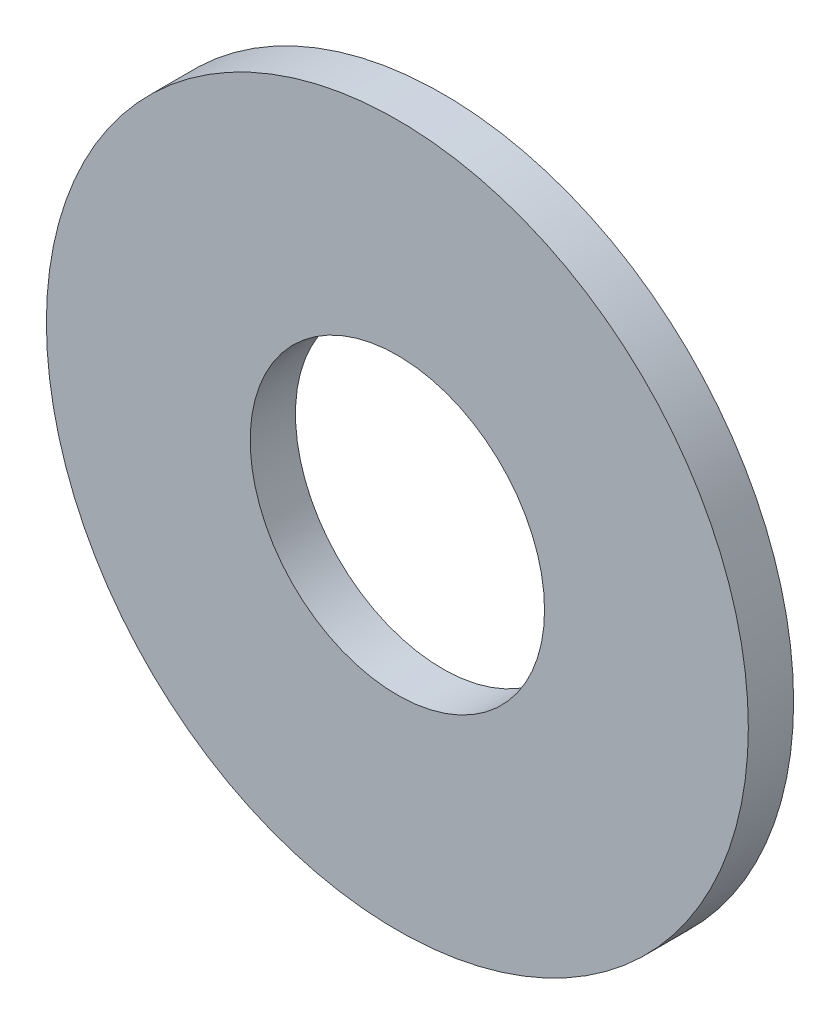
ISO-10303-21;
HEADER;
FILE_DESCRIPTION(('STEP AP214'),'2;1');
FILE_NAME('part.step','',(''),(''),'','','');
FILE_SCHEMA(('AUTOMOTIVE_DESIGN { 1 0 10303 214 1 1 1 1 }'));
ENDSEC;
DATA;
#1=APPLICATION_CONTEXT('core data for automotive mechanical design processes');
#2=APPLICATION_PROTOCOL_DEFINITION('international standard','automotive_design',2000,#1);
#3=PRODUCT_CONTEXT('',#1,'mechanical');
#4=PRODUCT('Part','Part','',(#3));
#5=PRODUCT_RELATED_PRODUCT_CATEGORY('part','',(#4));
#6=PRODUCT_DEFINITION_FORMATION('','',#4);
#7=PRODUCT_DEFINITION_CONTEXT('part definition',#1,'design');
#8=PRODUCT_DEFINITION('design','',#6,#7);
#9=PRODUCT_DEFINITION_SHAPE('','',#8);
#10=(LENGTH_UNIT() NAMED_UNIT(*) SI_UNIT(.MILLI.,.METRE.));
#11=(NAMED_UNIT(*) PLANE_ANGLE_UNIT() SI_UNIT($,.RADIAN.));
#12=(NAMED_UNIT(*) SI_UNIT($,.STERADIAN.) SOLID_ANGLE_UNIT());
#13=UNCERTAINTY_MEASURE_WITH_UNIT(LENGTH_MEASURE(1.E-05),#10,'distance_accuracy_value','');
#14=(GEOMETRIC_REPRESENTATION_CONTEXT(3) GLOBAL_UNCERTAINTY_ASSIGNED_CONTEXT((#13)) GLOBAL_UNIT_ASSIGNED_CONTEXT((#10,
#11,#12)) REPRESENTATION_CONTEXT('',''));
#15=CARTESIAN_POINT('',(0.,0.,0.));
#16=DIRECTION('',(0.,0.,1.));
#17=DIRECTION('',(1.,0.,0.));
#18=AXIS2_PLACEMENT_3D('',#15,#16,#17);
#19=CARTESIAN_POINT('',(0.,0.,6.35));
#20=DIRECTION('',(0.,0.,1.));
#21=DIRECTION('',(1.,0.,0.));
#22=AXIS2_PLACEMENT_3D('',#19,#20,#21);
#23=PLANE('',#22);
#24=CARTESIAN_POINT('',(0.,0.,6.35));
#25=DIRECTION('',(0.,0.,1.));
#26=DIRECTION('',(1.,0.,0.));
#27=AXIS2_PLACEMENT_3D('',#24,#25,#26);
#28=CIRCLE('',#27,49.2125);
#29=CARTESIAN_POINT('',(49.2125,0.,6.35));
#30=VERTEX_POINT('',#29);
#31=EDGE_CURVE('E10',#30,#30,#28,.T.);
#32=ORIENTED_EDGE('',*,*,#31,.T.);
#33=EDGE_LOOP('',(#32));
#34=FACE_BOUND('',#33,.T.);
#35=CARTESIAN_POINT('',(0.,0.,6.35));
#36=DIRECTION('',(0.,0.,1.));
#37=DIRECTION('',(1.,0.,0.));
#38=AXIS2_PLACEMENT_3D('',#35,#36,#37);
#39=CIRCLE('',#38,20.6375);
#40=CARTESIAN_POINT('',(20.6375,0.,6.35));
#41=VERTEX_POINT('',#40);
#42=EDGE_CURVE('E50',#41,#41,#39,.T.);
#43=ORIENTED_EDGE('',*,*,#42,.F.);
#44=EDGE_LOOP('',(#43));
#45=FACE_BOUND('',#44,.T.);
#46=ADVANCED_FACE('F37',(#34,#45),#23,.T.);
#47=CARTESIAN_POINT('',(0.,0.,0.));
#48=DIRECTION('',(0.,0.,1.));
#49=DIRECTION('',(1.,0.,0.));
#50=AXIS2_PLACEMENT_3D('',#47,#48,#49);
#51=PLANE('',#50);
#52=CARTESIAN_POINT('',(0.,0.,0.));
#53=DIRECTION('',(0.,0.,1.));
#54=DIRECTION('',(1.,0.,0.));
#55=AXIS2_PLACEMENT_3D('',#52,#53,#54);
#56=CIRCLE('',#55,49.2125);
#57=CARTESIAN_POINT('',(49.2125,0.,0.));
#58=VERTEX_POINT('',#57);
#59=EDGE_CURVE('E41',#58,#58,#56,.T.);
#60=ORIENTED_EDGE('',*,*,#59,.F.);
#61=EDGE_LOOP('',(#60));
#62=FACE_BOUND('',#61,.T.);
#63=CARTESIAN_POINT('',(0.,0.,0.));
#64=DIRECTION('',(0.,0.,1.));
#65=DIRECTION('',(1.,0.,0.));
#66=AXIS2_PLACEMENT_3D('',#63,#64,#65);
#67=CIRCLE('',#66,20.6375);
#68=CARTESIAN_POINT('',(20.6375,0.,0.));
#69=VERTEX_POINT('',#68);
#70=EDGE_CURVE('E52',#69,#69,#67,.T.);
#71=ORIENTED_EDGE('',*,*,#70,.T.);
#72=EDGE_LOOP('',(#71));
#73=FACE_BOUND('',#72,.T.);
#74=ADVANCED_FACE('F64',(#62,#73),#51,.F.);
#75=CARTESIAN_POINT('',(0.,0.,6.35));
#76=DIRECTION('',(0.,0.,-1.));
#77=DIRECTION('',(-1.,0.,0.));
#78=AXIS2_PLACEMENT_3D('',#75,#76,#77);
#79=CYLINDRICAL_SURFACE('',#78,49.2125);
#80=ORIENTED_EDGE('',*,*,#31,.F.);
#81=EDGE_LOOP('',(#80));
#82=FACE_BOUND('',#81,.T.);
#83=ORIENTED_EDGE('',*,*,#59,.T.);
#84=EDGE_LOOP('',(#83));
#85=FACE_BOUND('',#84,.T.);
#86=ADVANCED_FACE('F39',(#82,#85),#79,.T.);
#87=CARTESIAN_POINT('',(0.,0.,6.35));
#88=DIRECTION('',(0.,0.,-1.));
#89=DIRECTION('',(-1.,0.,0.));
#90=AXIS2_PLACEMENT_3D('',#87,#88,#89);
#91=CYLINDRICAL_SURFACE('',#90,20.6375);
#92=ORIENTED_EDGE('',*,*,#42,.T.);
#93=EDGE_LOOP('',(#92));
#94=FACE_BOUND('',#93,.T.);
#95=ORIENTED_EDGE('',*,*,#70,.F.);
#96=EDGE_LOOP('',(#95));
#97=FACE_BOUND('',#96,.T.);
#98=ADVANCED_FACE('F60',(#94,#97),#91,.F.);
#99=CLOSED_SHELL('',(#46,#74,#86,#98));
#100=MANIFOLD_SOLID_BREP('B2',#99);
#101=ADVANCED_BREP_SHAPE_REPRESENTATION('',(#18,#100),#14);
#102=SHAPE_DEFINITION_REPRESENTATION(#9,#101);
ENDSEC;
END-ISO-10303-21;
